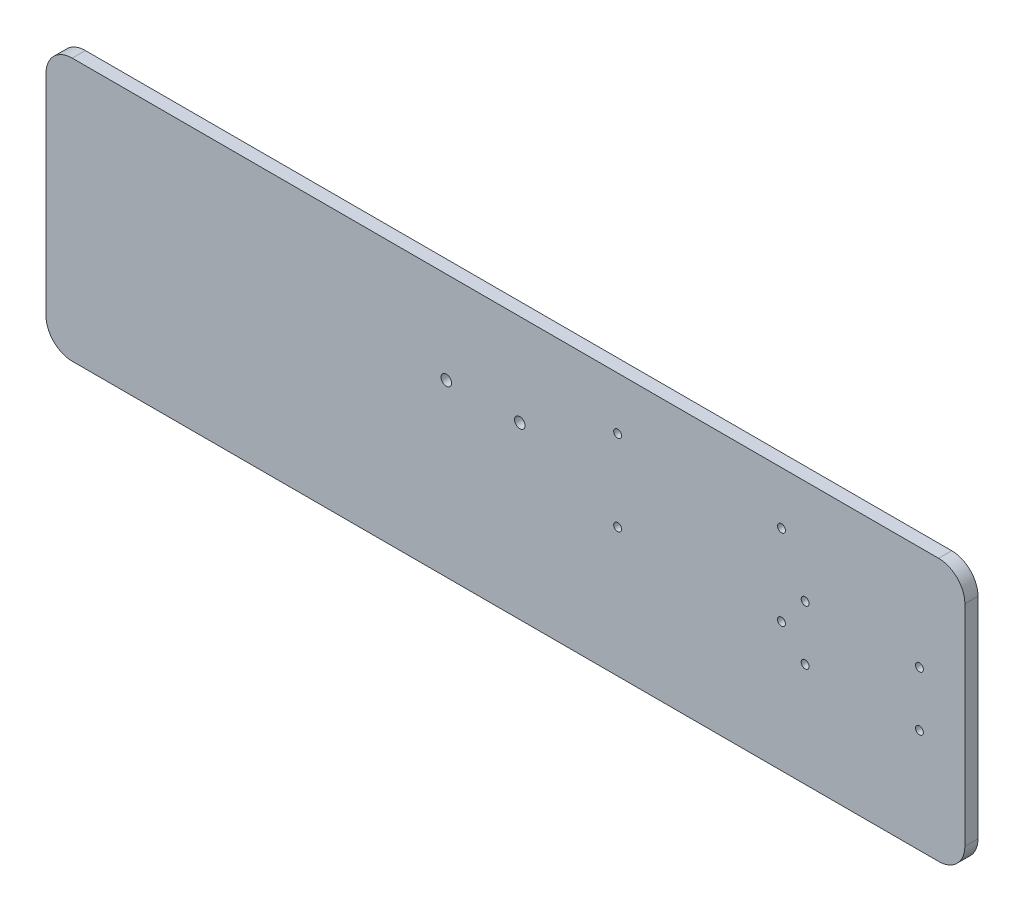
ISO-10303-21;
HEADER;
FILE_DESCRIPTION(('STEP AP214'),'2;1');
FILE_NAME('part.step','',(''),(''),'','','');
FILE_SCHEMA(('AUTOMOTIVE_DESIGN { 1 0 10303 214 1 1 1 1 }'));
ENDSEC;
DATA;
#1=APPLICATION_CONTEXT('core data for automotive mechanical design processes');
#2=APPLICATION_PROTOCOL_DEFINITION('international standard','automotive_design',2000,#1);
#3=PRODUCT_CONTEXT('',#1,'mechanical');
#4=PRODUCT('Part','Part','',(#3));
#5=PRODUCT_RELATED_PRODUCT_CATEGORY('part','',(#4));
#6=PRODUCT_DEFINITION_FORMATION('','',#4);
#7=PRODUCT_DEFINITION_CONTEXT('part definition',#1,'design');
#8=PRODUCT_DEFINITION('design','',#6,#7);
#9=PRODUCT_DEFINITION_SHAPE('','',#8);
#10=(LENGTH_UNIT() NAMED_UNIT(*) SI_UNIT(.MILLI.,.METRE.));
#11=(NAMED_UNIT(*) PLANE_ANGLE_UNIT() SI_UNIT($,.RADIAN.));
#12=(NAMED_UNIT(*) SI_UNIT($,.STERADIAN.) SOLID_ANGLE_UNIT());
#13=UNCERTAINTY_MEASURE_WITH_UNIT(LENGTH_MEASURE(1.E-05),#10,'distance_accuracy_value','');
#14=(GEOMETRIC_REPRESENTATION_CONTEXT(3) GLOBAL_UNCERTAINTY_ASSIGNED_CONTEXT((#13)) GLOBAL_UNIT_ASSIGNED_CONTEXT((#10,
#11,#12)) REPRESENTATION_CONTEXT('',''));
#15=CARTESIAN_POINT('',(0.,0.,0.));
#16=DIRECTION('',(0.,0.,1.));
#17=DIRECTION('',(1.,0.,0.));
#18=AXIS2_PLACEMENT_3D('',#15,#16,#17);
#19=CARTESIAN_POINT('',(165.,-40.,5.));
#20=DIRECTION('',(0.,0.,-1.));
#21=DIRECTION('',(-1.,0.,0.));
#22=AXIS2_PLACEMENT_3D('',#19,#20,#21);
#23=CYLINDRICAL_SURFACE('',#22,10.);
#24=CARTESIAN_POINT('',(165.,-40.,0.));
#25=DIRECTION('',(0.,0.,1.));
#26=DIRECTION('',(1.,0.,0.));
#27=AXIS2_PLACEMENT_3D('',#24,#25,#26);
#28=CIRCLE('',#27,10.);
#29=CARTESIAN_POINT('',(165.,-50.,0.));
#30=VERTEX_POINT('',#29);
#31=CARTESIAN_POINT('',(175.,-39.9999999999999,0.));
#32=VERTEX_POINT('',#31);
#33=EDGE_CURVE('E135',#30,#32,#28,.T.);
#34=ORIENTED_EDGE('',*,*,#33,.T.);
#35=DIRECTION('',(0.,0.,-1.));
#36=VECTOR('',#35,1.);
#37=CARTESIAN_POINT('',(175.,-39.9999999999999,5.));
#38=LINE('',#37,#36);
#39=CARTESIAN_POINT('',(175.,-39.9999999999999,5.));
#40=VERTEX_POINT('',#39);
#41=EDGE_CURVE('E11',#40,#32,#38,.T.);
#42=ORIENTED_EDGE('',*,*,#41,.F.);
#43=CARTESIAN_POINT('',(165.,-40.,5.));
#44=DIRECTION('',(0.,0.,1.));
#45=DIRECTION('',(1.,0.,0.));
#46=AXIS2_PLACEMENT_3D('',#43,#44,#45);
#47=CIRCLE('',#46,10.);
#48=CARTESIAN_POINT('',(165.,-50.,5.));
#49=VERTEX_POINT('',#48);
#50=EDGE_CURVE('E150',#49,#40,#47,.T.);
#51=ORIENTED_EDGE('',*,*,#50,.F.);
#52=DIRECTION('',(0.,0.,-1.));
#53=VECTOR('',#52,1.);
#54=CARTESIAN_POINT('',(165.,-50.,5.));
#55=LINE('',#54,#53);
#56=EDGE_CURVE('E131',#49,#30,#55,.T.);
#57=ORIENTED_EDGE('',*,*,#56,.T.);
#58=EDGE_LOOP('',(#34,#42,#51,#57));
#59=FACE_BOUND('',#58,.T.);
#60=ADVANCED_FACE('F39',(#59),#23,.T.);
#61=CARTESIAN_POINT('',(175.,-39.9999999999999,5.));
#62=DIRECTION('',(-1.,0.,0.));
#63=DIRECTION('',(0.,0.,1.));
#64=AXIS2_PLACEMENT_3D('',#61,#62,#63);
#65=PLANE('',#64);
#66=DIRECTION('',(0.,1.,0.));
#67=VECTOR('',#66,1.);
#68=CARTESIAN_POINT('',(175.,-39.9999999999999,0.));
#69=LINE('',#68,#67);
#70=CARTESIAN_POINT('',(175.,39.9999999999999,0.));
#71=VERTEX_POINT('',#70);
#72=EDGE_CURVE('E138',#32,#71,#69,.T.);
#73=ORIENTED_EDGE('',*,*,#72,.T.);
#74=DIRECTION('',(0.,0.,-1.));
#75=VECTOR('',#74,1.);
#76=CARTESIAN_POINT('',(175.,39.9999999999999,5.));
#77=LINE('',#76,#75);
#78=CARTESIAN_POINT('',(175.,39.9999999999999,5.));
#79=VERTEX_POINT('',#78);
#80=EDGE_CURVE('E47',#79,#71,#77,.T.);
#81=ORIENTED_EDGE('',*,*,#80,.F.);
#82=DIRECTION('',(0.,1.,0.));
#83=VECTOR('',#82,1.);
#84=CARTESIAN_POINT('',(175.,-39.9999999999999,5.));
#85=LINE('',#84,#83);
#86=EDGE_CURVE('E98',#40,#79,#85,.T.);
#87=ORIENTED_EDGE('',*,*,#86,.F.);
#88=ORIENTED_EDGE('',*,*,#41,.T.);
#89=EDGE_LOOP('',(#73,#81,#87,#88));
#90=FACE_BOUND('',#89,.T.);
#91=ADVANCED_FACE('F266',(#90),#65,.F.);
#92=CARTESIAN_POINT('',(165.,40.,5.));
#93=DIRECTION('',(0.,0.,-1.));
#94=DIRECTION('',(-1.,0.,0.));
#95=AXIS2_PLACEMENT_3D('',#92,#93,#94);
#96=CYLINDRICAL_SURFACE('',#95,10.);
#97=CARTESIAN_POINT('',(165.,40.,0.));
#98=DIRECTION('',(0.,0.,1.));
#99=DIRECTION('',(-1.,0.,0.));
#100=AXIS2_PLACEMENT_3D('',#97,#98,#99);
#101=CIRCLE('',#100,10.);
#102=CARTESIAN_POINT('',(165.,50.,0.));
#103=VERTEX_POINT('',#102);
#104=EDGE_CURVE('E141',#71,#103,#101,.T.);
#105=ORIENTED_EDGE('',*,*,#104,.T.);
#106=DIRECTION('',(0.,0.,-1.));
#107=VECTOR('',#106,1.);
#108=CARTESIAN_POINT('',(165.,50.,5.));
#109=LINE('',#108,#107);
#110=CARTESIAN_POINT('',(165.,50.,5.));
#111=VERTEX_POINT('',#110);
#112=EDGE_CURVE('E157',#111,#103,#109,.T.);
#113=ORIENTED_EDGE('',*,*,#112,.F.);
#114=CARTESIAN_POINT('',(165.,40.,5.));
#115=DIRECTION('',(0.,0.,1.));
#116=DIRECTION('',(-1.,0.,0.));
#117=AXIS2_PLACEMENT_3D('',#114,#115,#116);
#118=CIRCLE('',#117,10.);
#119=EDGE_CURVE('E165',#79,#111,#118,.T.);
#120=ORIENTED_EDGE('',*,*,#119,.F.);
#121=ORIENTED_EDGE('',*,*,#80,.T.);
#122=EDGE_LOOP('',(#105,#113,#120,#121));
#123=FACE_BOUND('',#122,.T.);
#124=ADVANCED_FACE('F163',(#123),#96,.T.);
#125=CARTESIAN_POINT('',(-165.,50.,5.));
#126=DIRECTION('',(0.,-1.,0.));
#127=DIRECTION('',(0.,0.,-1.));
#128=AXIS2_PLACEMENT_3D('',#125,#126,#127);
#129=PLANE('',#128);
#130=DIRECTION('',(-1.,0.,0.));
#131=VECTOR('',#130,1.);
#132=CARTESIAN_POINT('',(-165.,50.,0.));
#133=LINE('',#132,#131);
#134=CARTESIAN_POINT('',(-165.,50.,0.));
#135=VERTEX_POINT('',#134);
#136=EDGE_CURVE('E143',#103,#135,#133,.T.);
#137=ORIENTED_EDGE('',*,*,#136,.T.);
#138=DIRECTION('',(0.,0.,-1.));
#139=VECTOR('',#138,1.);
#140=CARTESIAN_POINT('',(-165.,50.,5.));
#141=LINE('',#140,#139);
#142=CARTESIAN_POINT('',(-165.,50.,5.));
#143=VERTEX_POINT('',#142);
#144=EDGE_CURVE('E154',#143,#135,#141,.T.);
#145=ORIENTED_EDGE('',*,*,#144,.F.);
#146=DIRECTION('',(-1.,0.,0.));
#147=VECTOR('',#146,1.);
#148=CARTESIAN_POINT('',(-165.,50.,5.));
#149=LINE('',#148,#147);
#150=EDGE_CURVE('E177',#111,#143,#149,.T.);
#151=ORIENTED_EDGE('',*,*,#150,.F.);
#152=ORIENTED_EDGE('',*,*,#112,.T.);
#153=EDGE_LOOP('',(#137,#145,#151,#152));
#154=FACE_BOUND('',#153,.T.);
#155=ADVANCED_FACE('F173',(#154),#129,.F.);
#156=CARTESIAN_POINT('',(-165.,40.,5.));
#157=DIRECTION('',(0.,0.,-1.));
#158=DIRECTION('',(-1.,0.,0.));
#159=AXIS2_PLACEMENT_3D('',#156,#157,#158);
#160=CYLINDRICAL_SURFACE('',#159,10.);
#161=CARTESIAN_POINT('',(-165.,40.,0.));
#162=DIRECTION('',(0.,0.,1.));
#163=DIRECTION('',(-1.,0.,0.));
#164=AXIS2_PLACEMENT_3D('',#161,#162,#163);
#165=CIRCLE('',#164,10.);
#166=CARTESIAN_POINT('',(-175.,39.9999999999999,0.));
#167=VERTEX_POINT('',#166);
#168=EDGE_CURVE('E145',#135,#167,#165,.T.);
#169=ORIENTED_EDGE('',*,*,#168,.T.);
#170=DIRECTION('',(0.,0.,-1.));
#171=VECTOR('',#170,1.);
#172=CARTESIAN_POINT('',(-175.,39.9999999999999,5.));
#173=LINE('',#172,#171);
#174=CARTESIAN_POINT('',(-175.,39.9999999999999,5.));
#175=VERTEX_POINT('',#174);
#176=EDGE_CURVE('E126',#175,#167,#173,.T.);
#177=ORIENTED_EDGE('',*,*,#176,.F.);
#178=CARTESIAN_POINT('',(-165.,40.,5.));
#179=DIRECTION('',(0.,0.,1.));
#180=DIRECTION('',(-1.,0.,0.));
#181=AXIS2_PLACEMENT_3D('',#178,#179,#180);
#182=CIRCLE('',#181,10.);
#183=EDGE_CURVE('E117',#143,#175,#182,.T.);
#184=ORIENTED_EDGE('',*,*,#183,.F.);
#185=ORIENTED_EDGE('',*,*,#144,.T.);
#186=EDGE_LOOP('',(#169,#177,#184,#185));
#187=FACE_BOUND('',#186,.T.);
#188=ADVANCED_FACE('F176',(#187),#160,.T.);
#189=CARTESIAN_POINT('',(-175.,-39.9999999999999,5.));
#190=DIRECTION('',(1.,0.,0.));
#191=DIRECTION('',(0.,0.,-1.));
#192=AXIS2_PLACEMENT_3D('',#189,#190,#191);
#193=PLANE('',#192);
#194=DIRECTION('',(0.,-1.,0.));
#195=VECTOR('',#194,1.);
#196=CARTESIAN_POINT('',(-175.,-39.9999999999999,0.));
#197=LINE('',#196,#195);
#198=CARTESIAN_POINT('',(-175.,-40.,0.));
#199=VERTEX_POINT('',#198);
#200=EDGE_CURVE('E125',#167,#199,#197,.T.);
#201=ORIENTED_EDGE('',*,*,#200,.T.);
#202=DIRECTION('',(0.,0.,-1.));
#203=VECTOR('',#202,1.);
#204=CARTESIAN_POINT('',(-175.,-40.,5.));
#205=LINE('',#204,#203);
#206=CARTESIAN_POINT('',(-175.,-40.,5.));
#207=VERTEX_POINT('',#206);
#208=EDGE_CURVE('E122',#207,#199,#205,.T.);
#209=ORIENTED_EDGE('',*,*,#208,.F.);
#210=DIRECTION('',(0.,-1.,0.));
#211=VECTOR('',#210,1.);
#212=CARTESIAN_POINT('',(-175.,-39.9999999999999,5.));
#213=LINE('',#212,#211);
#214=EDGE_CURVE('E111',#175,#207,#213,.T.);
#215=ORIENTED_EDGE('',*,*,#214,.F.);
#216=ORIENTED_EDGE('',*,*,#176,.T.);
#217=EDGE_LOOP('',(#201,#209,#215,#216));
#218=FACE_BOUND('',#217,.T.);
#219=ADVANCED_FACE('F123',(#218),#193,.F.);
#220=CARTESIAN_POINT('',(-165.,-40.,5.));
#221=DIRECTION('',(0.,0.,-1.));
#222=DIRECTION('',(-1.,0.,0.));
#223=AXIS2_PLACEMENT_3D('',#220,#221,#222);
#224=CYLINDRICAL_SURFACE('',#223,10.);
#225=CARTESIAN_POINT('',(-165.,-40.,0.));
#226=DIRECTION('',(0.,0.,1.));
#227=DIRECTION('',(-1.,0.,0.));
#228=AXIS2_PLACEMENT_3D('',#225,#226,#227);
#229=CIRCLE('',#228,10.);
#230=CARTESIAN_POINT('',(-165.,-50.,0.));
#231=VERTEX_POINT('',#230);
#232=EDGE_CURVE('E84',#199,#231,#229,.T.);
#233=ORIENTED_EDGE('',*,*,#232,.T.);
#234=DIRECTION('',(0.,0.,-1.));
#235=VECTOR('',#234,1.);
#236=CARTESIAN_POINT('',(-165.,-50.,5.));
#237=LINE('',#236,#235);
#238=CARTESIAN_POINT('',(-165.,-50.,5.));
#239=VERTEX_POINT('',#238);
#240=EDGE_CURVE('E127',#239,#231,#237,.T.);
#241=ORIENTED_EDGE('',*,*,#240,.F.);
#242=CARTESIAN_POINT('',(-165.,-40.,5.));
#243=DIRECTION('',(0.,0.,1.));
#244=DIRECTION('',(-1.,0.,0.));
#245=AXIS2_PLACEMENT_3D('',#242,#243,#244);
#246=CIRCLE('',#245,10.);
#247=EDGE_CURVE('E115',#207,#239,#246,.T.);
#248=ORIENTED_EDGE('',*,*,#247,.F.);
#249=ORIENTED_EDGE('',*,*,#208,.T.);
#250=EDGE_LOOP('',(#233,#241,#248,#249));
#251=FACE_BOUND('',#250,.T.);
#252=ADVANCED_FACE('F129',(#251),#224,.T.);
#253=CARTESIAN_POINT('',(-165.,-50.,5.));
#254=DIRECTION('',(0.,1.,0.));
#255=DIRECTION('',(0.,0.,1.));
#256=AXIS2_PLACEMENT_3D('',#253,#254,#255);
#257=PLANE('',#256);
#258=DIRECTION('',(1.,0.,0.));
#259=VECTOR('',#258,1.);
#260=CARTESIAN_POINT('',(-165.,-50.,0.));
#261=LINE('',#260,#259);
#262=EDGE_CURVE('E90',#231,#30,#261,.T.);
#263=ORIENTED_EDGE('',*,*,#262,.T.);
#264=ORIENTED_EDGE('',*,*,#56,.F.);
#265=DIRECTION('',(1.,0.,0.));
#266=VECTOR('',#265,1.);
#267=CARTESIAN_POINT('',(-165.,-50.,5.));
#268=LINE('',#267,#266);
#269=EDGE_CURVE('E55',#239,#49,#268,.T.);
#270=ORIENTED_EDGE('',*,*,#269,.F.);
#271=ORIENTED_EDGE('',*,*,#240,.T.);
#272=EDGE_LOOP('',(#263,#264,#270,#271));
#273=FACE_BOUND('',#272,.T.);
#274=ADVANCED_FACE('F273',(#273),#257,.F.);
#275=CARTESIAN_POINT('',(165.,-40.,5.));
#276=DIRECTION('',(0.,0.,1.));
#277=DIRECTION('',(1.,0.,0.));
#278=AXIS2_PLACEMENT_3D('',#275,#276,#277);
#279=PLANE('',#278);
#280=CARTESIAN_POINT('',(157.699999999983,-10.395000000064,5.));
#281=DIRECTION('',(0.,0.,1.));
#282=DIRECTION('',(1.,0.,0.));
#283=AXIS2_PLACEMENT_3D('',#280,#281,#282);
#284=CIRCLE('',#283,1.50000000000215);
#285=CARTESIAN_POINT('',(159.199999999985,-10.395000000064,5.));
#286=VERTEX_POINT('',#285);
#287=EDGE_CURVE('E213',#286,#286,#284,.F.);
#288=ORIENTED_EDGE('',*,*,#287,.T.);
#289=EDGE_LOOP('',(#288));
#290=FACE_BOUND('',#289,.T.);
#291=CARTESIAN_POINT('',(114.149999999983,10.3949999999361,5.));
#292=DIRECTION('',(0.,0.,1.));
#293=DIRECTION('',(1.,0.,0.));
#294=AXIS2_PLACEMENT_3D('',#291,#292,#293);
#295=CIRCLE('',#294,1.50000000000215);
#296=CARTESIAN_POINT('',(115.649999999985,10.3949999999361,5.));
#297=VERTEX_POINT('',#296);
#298=EDGE_CURVE('E220',#297,#297,#295,.F.);
#299=ORIENTED_EDGE('',*,*,#298,.T.);
#300=EDGE_LOOP('',(#299));
#301=FACE_BOUND('',#300,.T.);
#302=CARTESIAN_POINT('',(105.153812798276,-0.814499843748255,5.));
#303=DIRECTION('',(0.,0.,1.));
#304=DIRECTION('',(1.,0.,0.));
#305=AXIS2_PLACEMENT_3D('',#302,#303,#304);
#306=CIRCLE('',#305,1.5);
#307=CARTESIAN_POINT('',(106.653812798276,-0.814499843748255,5.));
#308=VERTEX_POINT('',#307);
#309=EDGE_CURVE('E226',#308,#308,#306,.F.);
#310=ORIENTED_EDGE('',*,*,#309,.T.);
#311=EDGE_LOOP('',(#310));
#312=FACE_BOUND('',#311,.T.);
#313=CARTESIAN_POINT('',(42.7383828932441,-0.814499843748255,5.));
#314=DIRECTION('',(0.,0.,1.));
#315=DIRECTION('',(1.,0.,0.));
#316=AXIS2_PLACEMENT_3D('',#313,#314,#315);
#317=CIRCLE('',#316,1.5);
#318=CARTESIAN_POINT('',(44.2383828932441,-0.814499843748255,5.));
#319=VERTEX_POINT('',#318);
#320=EDGE_CURVE('E232',#319,#319,#317,.F.);
#321=ORIENTED_EDGE('',*,*,#320,.T.);
#322=EDGE_LOOP('',(#321));
#323=FACE_BOUND('',#322,.T.);
#324=CARTESIAN_POINT('',(42.7383828932441,30.,5.));
#325=DIRECTION('',(0.,0.,1.));
#326=DIRECTION('',(1.,0.,0.));
#327=AXIS2_PLACEMENT_3D('',#324,#325,#326);
#328=CIRCLE('',#327,1.5);
#329=CARTESIAN_POINT('',(44.2383828932441,30.,5.));
#330=VERTEX_POINT('',#329);
#331=EDGE_CURVE('E189',#330,#330,#328,.F.);
#332=ORIENTED_EDGE('',*,*,#331,.T.);
#333=EDGE_LOOP('',(#332));
#334=FACE_BOUND('',#333,.T.);
#335=CARTESIAN_POINT('',(105.153812798276,30.,5.));
#336=DIRECTION('',(0.,0.,1.));
#337=DIRECTION('',(1.,0.,0.));
#338=AXIS2_PLACEMENT_3D('',#335,#336,#337);
#339=CIRCLE('',#338,1.5);
#340=CARTESIAN_POINT('',(106.653812798276,30.,5.));
#341=VERTEX_POINT('',#340);
#342=EDGE_CURVE('E196',#341,#341,#339,.F.);
#343=ORIENTED_EDGE('',*,*,#342,.T.);
#344=EDGE_LOOP('',(#343));
#345=FACE_BOUND('',#344,.T.);
#346=CARTESIAN_POINT('',(114.149999999983,-10.3950000000639,5.));
#347=DIRECTION('',(0.,0.,1.));
#348=DIRECTION('',(1.,0.,0.));
#349=AXIS2_PLACEMENT_3D('',#346,#347,#348);
#350=CIRCLE('',#349,1.50000000000215);
#351=CARTESIAN_POINT('',(115.649999999985,-10.3950000000639,5.));
#352=VERTEX_POINT('',#351);
#353=EDGE_CURVE('E202',#352,#352,#350,.F.);
#354=ORIENTED_EDGE('',*,*,#353,.T.);
#355=EDGE_LOOP('',(#354));
#356=FACE_BOUND('',#355,.T.);
#357=CARTESIAN_POINT('',(-22.5281323130132,15.,5.));
#358=DIRECTION('',(0.,0.,1.));
#359=DIRECTION('',(1.,0.,0.));
#360=AXIS2_PLACEMENT_3D('',#357,#358,#359);
#361=CIRCLE('',#360,2.);
#362=CARTESIAN_POINT('',(-20.5281323130132,15.,5.));
#363=VERTEX_POINT('',#362);
#364=EDGE_CURVE('E208',#363,#363,#361,.F.);
#365=ORIENTED_EDGE('',*,*,#364,.T.);
#366=EDGE_LOOP('',(#365));
#367=FACE_BOUND('',#366,.T.);
#368=CARTESIAN_POINT('',(157.699999999983,10.394999999936,5.));
#369=DIRECTION('',(0.,0.,1.));
#370=DIRECTION('',(1.,0.,0.));
#371=AXIS2_PLACEMENT_3D('',#368,#369,#370);
#372=CIRCLE('',#371,1.50000000000215);
#373=CARTESIAN_POINT('',(159.199999999985,10.394999999936,5.));
#374=VERTEX_POINT('',#373);
#375=EDGE_CURVE('E237',#374,#374,#372,.F.);
#376=ORIENTED_EDGE('',*,*,#375,.T.);
#377=EDGE_LOOP('',(#376));
#378=FACE_BOUND('',#377,.T.);
#379=CARTESIAN_POINT('',(5.45708981157242,15.,5.));
#380=DIRECTION('',(0.,0.,1.));
#381=DIRECTION('',(1.,0.,0.));
#382=AXIS2_PLACEMENT_3D('',#379,#380,#381);
#383=CIRCLE('',#382,2.);
#384=CARTESIAN_POINT('',(7.45708981157242,15.,5.));
#385=VERTEX_POINT('',#384);
#386=EDGE_CURVE('E183',#385,#385,#383,.F.);
#387=ORIENTED_EDGE('',*,*,#386,.T.);
#388=EDGE_LOOP('',(#387));
#389=FACE_BOUND('',#388,.T.);
#390=ORIENTED_EDGE('',*,*,#50,.T.);
#391=ORIENTED_EDGE('',*,*,#86,.T.);
#392=ORIENTED_EDGE('',*,*,#119,.T.);
#393=ORIENTED_EDGE('',*,*,#150,.T.);
#394=ORIENTED_EDGE('',*,*,#183,.T.);
#395=ORIENTED_EDGE('',*,*,#214,.T.);
#396=ORIENTED_EDGE('',*,*,#247,.T.);
#397=ORIENTED_EDGE('',*,*,#269,.T.);
#398=EDGE_LOOP('',(#390,#391,#392,#393,#394,#395,#396,#397));
#399=FACE_BOUND('',#398,.T.);
#400=ADVANCED_FACE('F113',(#290,#301,#312,#323,#334,#345,#356,#367,#378,#389,#399),#279,.T.);
#401=CARTESIAN_POINT('',(165.,-40.,0.));
#402=DIRECTION('',(0.,0.,1.));
#403=DIRECTION('',(1.,0.,0.));
#404=AXIS2_PLACEMENT_3D('',#401,#402,#403);
#405=PLANE('',#404);
#406=CARTESIAN_POINT('',(157.699999999983,-10.395000000064,0.));
#407=DIRECTION('',(0.,0.,-1.));
#408=DIRECTION('',(-1.,0.,0.));
#409=AXIS2_PLACEMENT_3D('',#406,#407,#408);
#410=CIRCLE('',#409,1.50000000000215);
#411=CARTESIAN_POINT('',(156.199999999981,-10.395000000064,0.));
#412=VERTEX_POINT('',#411);
#413=EDGE_CURVE('E216',#412,#412,#410,.T.);
#414=ORIENTED_EDGE('',*,*,#413,.F.);
#415=EDGE_LOOP('',(#414));
#416=FACE_BOUND('',#415,.T.);
#417=CARTESIAN_POINT('',(114.149999999983,10.3949999999361,0.));
#418=DIRECTION('',(0.,0.,-1.));
#419=DIRECTION('',(-1.,0.,0.));
#420=AXIS2_PLACEMENT_3D('',#417,#418,#419);
#421=CIRCLE('',#420,1.50000000000215);
#422=CARTESIAN_POINT('',(112.649999999981,10.3949999999361,0.));
#423=VERTEX_POINT('',#422);
#424=EDGE_CURVE('E223',#423,#423,#421,.T.);
#425=ORIENTED_EDGE('',*,*,#424,.F.);
#426=EDGE_LOOP('',(#425));
#427=FACE_BOUND('',#426,.T.);
#428=CARTESIAN_POINT('',(105.153812798276,-0.814499843748255,0.));
#429=DIRECTION('',(0.,0.,-1.));
#430=DIRECTION('',(-1.,0.,0.));
#431=AXIS2_PLACEMENT_3D('',#428,#429,#430);
#432=CIRCLE('',#431,1.5);
#433=CARTESIAN_POINT('',(103.653812798276,-0.814499843748255,0.));
#434=VERTEX_POINT('',#433);
#435=EDGE_CURVE('E229',#434,#434,#432,.T.);
#436=ORIENTED_EDGE('',*,*,#435,.F.);
#437=EDGE_LOOP('',(#436));
#438=FACE_BOUND('',#437,.T.);
#439=CARTESIAN_POINT('',(42.7383828932441,-0.814499843748255,0.));
#440=DIRECTION('',(0.,0.,-1.));
#441=DIRECTION('',(-1.,0.,0.));
#442=AXIS2_PLACEMENT_3D('',#439,#440,#441);
#443=CIRCLE('',#442,1.5);
#444=CARTESIAN_POINT('',(41.2383828932441,-0.814499843748255,0.));
#445=VERTEX_POINT('',#444);
#446=EDGE_CURVE('E193',#445,#445,#443,.T.);
#447=ORIENTED_EDGE('',*,*,#446,.F.);
#448=EDGE_LOOP('',(#447));
#449=FACE_BOUND('',#448,.T.);
#450=CARTESIAN_POINT('',(42.7383828932441,30.,0.));
#451=DIRECTION('',(0.,0.,-1.));
#452=DIRECTION('',(-1.,0.,0.));
#453=AXIS2_PLACEMENT_3D('',#450,#451,#452);
#454=CIRCLE('',#453,1.5);
#455=CARTESIAN_POINT('',(41.2383828932441,30.,0.));
#456=VERTEX_POINT('',#455);
#457=EDGE_CURVE('E192',#456,#456,#454,.T.);
#458=ORIENTED_EDGE('',*,*,#457,.F.);
#459=EDGE_LOOP('',(#458));
#460=FACE_BOUND('',#459,.T.);
#461=CARTESIAN_POINT('',(105.153812798276,30.,0.));
#462=DIRECTION('',(0.,0.,-1.));
#463=DIRECTION('',(-1.,0.,0.));
#464=AXIS2_PLACEMENT_3D('',#461,#462,#463);
#465=CIRCLE('',#464,1.5);
#466=CARTESIAN_POINT('',(103.653812798276,30.,0.));
#467=VERTEX_POINT('',#466);
#468=EDGE_CURVE('E199',#467,#467,#465,.T.);
#469=ORIENTED_EDGE('',*,*,#468,.F.);
#470=EDGE_LOOP('',(#469));
#471=FACE_BOUND('',#470,.T.);
#472=CARTESIAN_POINT('',(114.149999999983,-10.3950000000639,0.));
#473=DIRECTION('',(0.,0.,-1.));
#474=DIRECTION('',(-1.,0.,0.));
#475=AXIS2_PLACEMENT_3D('',#472,#473,#474);
#476=CIRCLE('',#475,1.50000000000215);
#477=CARTESIAN_POINT('',(112.649999999981,-10.3950000000639,0.));
#478=VERTEX_POINT('',#477);
#479=EDGE_CURVE('E205',#478,#478,#476,.T.);
#480=ORIENTED_EDGE('',*,*,#479,.F.);
#481=EDGE_LOOP('',(#480));
#482=FACE_BOUND('',#481,.T.);
#483=CARTESIAN_POINT('',(-22.5281323130132,15.,0.));
#484=DIRECTION('',(0.,0.,-1.));
#485=DIRECTION('',(-1.,0.,0.));
#486=AXIS2_PLACEMENT_3D('',#483,#484,#485);
#487=CIRCLE('',#486,2.);
#488=CARTESIAN_POINT('',(-24.5281323130132,15.,0.));
#489=VERTEX_POINT('',#488);
#490=EDGE_CURVE('E186',#489,#489,#487,.T.);
#491=ORIENTED_EDGE('',*,*,#490,.F.);
#492=EDGE_LOOP('',(#491));
#493=FACE_BOUND('',#492,.T.);
#494=CARTESIAN_POINT('',(157.699999999983,10.394999999936,0.));
#495=DIRECTION('',(0.,0.,-1.));
#496=DIRECTION('',(-1.,0.,0.));
#497=AXIS2_PLACEMENT_3D('',#494,#495,#496);
#498=CIRCLE('',#497,1.50000000000215);
#499=CARTESIAN_POINT('',(156.199999999981,10.394999999936,0.));
#500=VERTEX_POINT('',#499);
#501=EDGE_CURVE('E217',#500,#500,#498,.T.);
#502=ORIENTED_EDGE('',*,*,#501,.F.);
#503=EDGE_LOOP('',(#502));
#504=FACE_BOUND('',#503,.T.);
#505=CARTESIAN_POINT('',(5.45708981157242,15.,0.));
#506=DIRECTION('',(0.,0.,-1.));
#507=DIRECTION('',(-1.,0.,0.));
#508=AXIS2_PLACEMENT_3D('',#505,#506,#507);
#509=CIRCLE('',#508,2.);
#510=CARTESIAN_POINT('',(3.45708981157242,15.,0.));
#511=VERTEX_POINT('',#510);
#512=EDGE_CURVE('E139',#511,#511,#509,.T.);
#513=ORIENTED_EDGE('',*,*,#512,.F.);
#514=EDGE_LOOP('',(#513));
#515=FACE_BOUND('',#514,.T.);
#516=ORIENTED_EDGE('',*,*,#33,.F.);
#517=ORIENTED_EDGE('',*,*,#262,.F.);
#518=ORIENTED_EDGE('',*,*,#232,.F.);
#519=ORIENTED_EDGE('',*,*,#200,.F.);
#520=ORIENTED_EDGE('',*,*,#168,.F.);
#521=ORIENTED_EDGE('',*,*,#136,.F.);
#522=ORIENTED_EDGE('',*,*,#104,.F.);
#523=ORIENTED_EDGE('',*,*,#72,.F.);
#524=EDGE_LOOP('',(#516,#517,#518,#519,#520,#521,#522,#523));
#525=FACE_BOUND('',#524,.T.);
#526=ADVANCED_FACE('F169',(#416,#427,#438,#449,#460,#471,#482,#493,#504,#515,#525),#405,.F.);
#527=CARTESIAN_POINT('',(5.45708981157242,15.,5.001));
#528=DIRECTION('',(0.,0.,-1.));
#529=DIRECTION('',(-1.,0.,0.));
#530=AXIS2_PLACEMENT_3D('',#527,#528,#529);
#531=CYLINDRICAL_SURFACE('',#530,2.);
#532=ORIENTED_EDGE('',*,*,#386,.F.);
#533=EDGE_LOOP('',(#532));
#534=FACE_BOUND('',#533,.T.);
#535=ORIENTED_EDGE('',*,*,#512,.T.);
#536=EDGE_LOOP('',(#535));
#537=FACE_BOUND('',#536,.T.);
#538=ADVANCED_FACE('F247',(#534,#537),#531,.F.);
#539=CARTESIAN_POINT('',(157.699999999983,10.394999999936,5.001));
#540=DIRECTION('',(0.,0.,-1.));
#541=DIRECTION('',(-1.,0.,0.));
#542=AXIS2_PLACEMENT_3D('',#539,#540,#541);
#543=CYLINDRICAL_SURFACE('',#542,1.50000000000215);
#544=ORIENTED_EDGE('',*,*,#375,.F.);
#545=EDGE_LOOP('',(#544));
#546=FACE_BOUND('',#545,.T.);
#547=ORIENTED_EDGE('',*,*,#501,.T.);
#548=EDGE_LOOP('',(#547));
#549=FACE_BOUND('',#548,.T.);
#550=ADVANCED_FACE('F243',(#546,#549),#543,.F.);
#551=CARTESIAN_POINT('',(-22.5281323130132,15.,5.001));
#552=DIRECTION('',(0.,0.,-1.));
#553=DIRECTION('',(-1.,0.,0.));
#554=AXIS2_PLACEMENT_3D('',#551,#552,#553);
#555=CYLINDRICAL_SURFACE('',#554,2.);
#556=ORIENTED_EDGE('',*,*,#364,.F.);
#557=EDGE_LOOP('',(#556));
#558=FACE_BOUND('',#557,.T.);
#559=ORIENTED_EDGE('',*,*,#490,.T.);
#560=EDGE_LOOP('',(#559));
#561=FACE_BOUND('',#560,.T.);
#562=ADVANCED_FACE('F259',(#558,#561),#555,.F.);
#563=CARTESIAN_POINT('',(114.149999999983,-10.3950000000639,5.001));
#564=DIRECTION('',(0.,0.,-1.));
#565=DIRECTION('',(-1.,0.,0.));
#566=AXIS2_PLACEMENT_3D('',#563,#564,#565);
#567=CYLINDRICAL_SURFACE('',#566,1.50000000000215);
#568=ORIENTED_EDGE('',*,*,#353,.F.);
#569=EDGE_LOOP('',(#568));
#570=FACE_BOUND('',#569,.T.);
#571=ORIENTED_EDGE('',*,*,#479,.T.);
#572=EDGE_LOOP('',(#571));
#573=FACE_BOUND('',#572,.T.);
#574=ADVANCED_FACE('F340',(#570,#573),#567,.F.);
#575=CARTESIAN_POINT('',(105.153812798276,30.,5.001));
#576=DIRECTION('',(0.,0.,-1.));
#577=DIRECTION('',(-1.,0.,0.));
#578=AXIS2_PLACEMENT_3D('',#575,#576,#577);
#579=CYLINDRICAL_SURFACE('',#578,1.5);
#580=ORIENTED_EDGE('',*,*,#342,.F.);
#581=EDGE_LOOP('',(#580));
#582=FACE_BOUND('',#581,.T.);
#583=ORIENTED_EDGE('',*,*,#468,.T.);
#584=EDGE_LOOP('',(#583));
#585=FACE_BOUND('',#584,.T.);
#586=ADVANCED_FACE('F350',(#582,#585),#579,.F.);
#587=CARTESIAN_POINT('',(42.7383828932441,30.,5.001));
#588=DIRECTION('',(0.,0.,-1.));
#589=DIRECTION('',(-1.,0.,0.));
#590=AXIS2_PLACEMENT_3D('',#587,#588,#589);
#591=CYLINDRICAL_SURFACE('',#590,1.5);
#592=ORIENTED_EDGE('',*,*,#331,.F.);
#593=EDGE_LOOP('',(#592));
#594=FACE_BOUND('',#593,.T.);
#595=ORIENTED_EDGE('',*,*,#457,.T.);
#596=EDGE_LOOP('',(#595));
#597=FACE_BOUND('',#596,.T.);
#598=ADVANCED_FACE('F360',(#594,#597),#591,.F.);
#599=CARTESIAN_POINT('',(42.7383828932441,-0.814499843748255,5.001));
#600=DIRECTION('',(0.,0.,-1.));
#601=DIRECTION('',(-1.,0.,0.));
#602=AXIS2_PLACEMENT_3D('',#599,#600,#601);
#603=CYLINDRICAL_SURFACE('',#602,1.5);
#604=ORIENTED_EDGE('',*,*,#320,.F.);
#605=EDGE_LOOP('',(#604));
#606=FACE_BOUND('',#605,.T.);
#607=ORIENTED_EDGE('',*,*,#446,.T.);
#608=EDGE_LOOP('',(#607));
#609=FACE_BOUND('',#608,.T.);
#610=ADVANCED_FACE('F370',(#606,#609),#603,.F.);
#611=CARTESIAN_POINT('',(105.153812798276,-0.814499843748255,5.001));
#612=DIRECTION('',(0.,0.,-1.));
#613=DIRECTION('',(-1.,0.,0.));
#614=AXIS2_PLACEMENT_3D('',#611,#612,#613);
#615=CYLINDRICAL_SURFACE('',#614,1.5);
#616=ORIENTED_EDGE('',*,*,#309,.F.);
#617=EDGE_LOOP('',(#616));
#618=FACE_BOUND('',#617,.T.);
#619=ORIENTED_EDGE('',*,*,#435,.T.);
#620=EDGE_LOOP('',(#619));
#621=FACE_BOUND('',#620,.T.);
#622=ADVANCED_FACE('F379',(#618,#621),#615,.F.);
#623=CARTESIAN_POINT('',(114.149999999983,10.3949999999361,5.001));
#624=DIRECTION('',(0.,0.,-1.));
#625=DIRECTION('',(-1.,0.,0.));
#626=AXIS2_PLACEMENT_3D('',#623,#624,#625);
#627=CYLINDRICAL_SURFACE('',#626,1.50000000000215);
#628=ORIENTED_EDGE('',*,*,#298,.F.);
#629=EDGE_LOOP('',(#628));
#630=FACE_BOUND('',#629,.T.);
#631=ORIENTED_EDGE('',*,*,#424,.T.);
#632=EDGE_LOOP('',(#631));
#633=FACE_BOUND('',#632,.T.);
#634=ADVANCED_FACE('F389',(#630,#633),#627,.F.);
#635=CARTESIAN_POINT('',(157.699999999983,-10.395000000064,5.001));
#636=DIRECTION('',(0.,0.,-1.));
#637=DIRECTION('',(-1.,0.,0.));
#638=AXIS2_PLACEMENT_3D('',#635,#636,#637);
#639=CYLINDRICAL_SURFACE('',#638,1.50000000000215);
#640=ORIENTED_EDGE('',*,*,#287,.F.);
#641=EDGE_LOOP('',(#640));
#642=FACE_BOUND('',#641,.T.);
#643=ORIENTED_EDGE('',*,*,#413,.T.);
#644=EDGE_LOOP('',(#643));
#645=FACE_BOUND('',#644,.T.);
#646=ADVANCED_FACE('F399',(#642,#645),#639,.F.);
#647=CLOSED_SHELL('',(#60,#91,#124,#155,#188,#219,#252,#274,#400,#526,#538,#550,#562,#574,#586,
#598,#610,#622,#634,#646));
#648=MANIFOLD_SOLID_BREP('B2',#647);
#649=ADVANCED_BREP_SHAPE_REPRESENTATION('',(#18,#648),#14);
#650=SHAPE_DEFINITION_REPRESENTATION(#9,#649);
ENDSEC;
END-ISO-10303-21;
